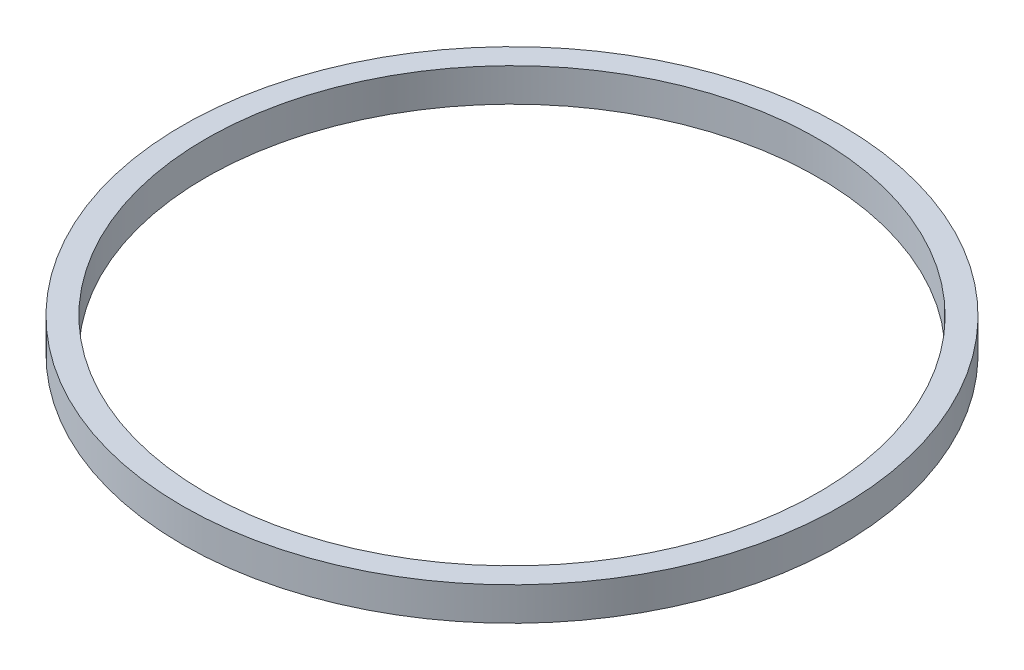
ISO-10303-21;
HEADER;
FILE_DESCRIPTION(('STEP AP214'),'2;1');
FILE_NAME('part.step','',(''),(''),'','','');
FILE_SCHEMA(('AUTOMOTIVE_DESIGN { 1 0 10303 214 1 1 1 1 }'));
ENDSEC;
DATA;
#1=APPLICATION_CONTEXT('core data for automotive mechanical design processes');
#2=APPLICATION_PROTOCOL_DEFINITION('international standard','automotive_design',2000,#1);
#3=PRODUCT_CONTEXT('',#1,'mechanical');
#4=PRODUCT('Part','Part','',(#3));
#5=PRODUCT_RELATED_PRODUCT_CATEGORY('part','',(#4));
#6=PRODUCT_DEFINITION_FORMATION('','',#4);
#7=PRODUCT_DEFINITION_CONTEXT('part definition',#1,'design');
#8=PRODUCT_DEFINITION('design','',#6,#7);
#9=PRODUCT_DEFINITION_SHAPE('','',#8);
#10=(LENGTH_UNIT() NAMED_UNIT(*) SI_UNIT(.MILLI.,.METRE.));
#11=(NAMED_UNIT(*) PLANE_ANGLE_UNIT() SI_UNIT($,.RADIAN.));
#12=(NAMED_UNIT(*) SI_UNIT($,.STERADIAN.) SOLID_ANGLE_UNIT());
#13=UNCERTAINTY_MEASURE_WITH_UNIT(LENGTH_MEASURE(1.E-05),#10,'distance_accuracy_value','');
#14=(GEOMETRIC_REPRESENTATION_CONTEXT(3) GLOBAL_UNCERTAINTY_ASSIGNED_CONTEXT((#13)) GLOBAL_UNIT_ASSIGNED_CONTEXT((#10,
#11,#12)) REPRESENTATION_CONTEXT('',''));
#15=CARTESIAN_POINT('',(0.,0.,0.));
#16=DIRECTION('',(0.,0.,1.));
#17=DIRECTION('',(1.,0.,0.));
#18=AXIS2_PLACEMENT_3D('',#15,#16,#17);
#19=CARTESIAN_POINT('',(0.,109.22,0.));
#20=DIRECTION('',(0.,1.,0.));
#21=DIRECTION('',(0.,0.,1.));
#22=AXIS2_PLACEMENT_3D('',#19,#20,#21);
#23=PLANE('',#22);
#24=CARTESIAN_POINT('',(0.,109.22,0.));
#25=DIRECTION('',(0.,1.,0.));
#26=DIRECTION('',(0.,0.,1.));
#27=AXIS2_PLACEMENT_3D('',#24,#25,#26);
#28=CIRCLE('',#27,1079.5);
#29=CARTESIAN_POINT('',(0.,109.22,1079.5));
#30=VERTEX_POINT('',#29);
#31=EDGE_CURVE('E10',#30,#30,#28,.T.);
#32=ORIENTED_EDGE('',*,*,#31,.T.);
#33=EDGE_LOOP('',(#32));
#34=FACE_BOUND('',#33,.T.);
#35=CARTESIAN_POINT('',(0.,109.22,0.));
#36=DIRECTION('',(0.,1.,0.));
#37=DIRECTION('',(0.,0.,1.));
#38=AXIS2_PLACEMENT_3D('',#35,#36,#37);
#39=CIRCLE('',#38,1003.3);
#40=CARTESIAN_POINT('',(0.,109.22,1003.3));
#41=VERTEX_POINT('',#40);
#42=EDGE_CURVE('E50',#41,#41,#39,.T.);
#43=ORIENTED_EDGE('',*,*,#42,.F.);
#44=EDGE_LOOP('',(#43));
#45=FACE_BOUND('',#44,.T.);
#46=ADVANCED_FACE('F37',(#34,#45),#23,.T.);
#47=CARTESIAN_POINT('',(0.,0.,0.));
#48=DIRECTION('',(0.,1.,0.));
#49=DIRECTION('',(0.,0.,1.));
#50=AXIS2_PLACEMENT_3D('',#47,#48,#49);
#51=PLANE('',#50);
#52=CARTESIAN_POINT('',(0.,0.,0.));
#53=DIRECTION('',(0.,1.,0.));
#54=DIRECTION('',(0.,0.,1.));
#55=AXIS2_PLACEMENT_3D('',#52,#53,#54);
#56=CIRCLE('',#55,1079.5);
#57=CARTESIAN_POINT('',(0.,0.,1079.5));
#58=VERTEX_POINT('',#57);
#59=EDGE_CURVE('E41',#58,#58,#56,.T.);
#60=ORIENTED_EDGE('',*,*,#59,.F.);
#61=EDGE_LOOP('',(#60));
#62=FACE_BOUND('',#61,.T.);
#63=CARTESIAN_POINT('',(0.,0.,0.));
#64=DIRECTION('',(0.,1.,0.));
#65=DIRECTION('',(0.,0.,1.));
#66=AXIS2_PLACEMENT_3D('',#63,#64,#65);
#67=CIRCLE('',#66,1003.3);
#68=CARTESIAN_POINT('',(0.,0.,1003.3));
#69=VERTEX_POINT('',#68);
#70=EDGE_CURVE('E52',#69,#69,#67,.T.);
#71=ORIENTED_EDGE('',*,*,#70,.T.);
#72=EDGE_LOOP('',(#71));
#73=FACE_BOUND('',#72,.T.);
#74=ADVANCED_FACE('F64',(#62,#73),#51,.F.);
#75=CARTESIAN_POINT('',(0.,109.22,0.));
#76=DIRECTION('',(0.,-1.,0.));
#77=DIRECTION('',(0.,0.,-1.));
#78=AXIS2_PLACEMENT_3D('',#75,#76,#77);
#79=CYLINDRICAL_SURFACE('',#78,1079.5);
#80=ORIENTED_EDGE('',*,*,#31,.F.);
#81=EDGE_LOOP('',(#80));
#82=FACE_BOUND('',#81,.T.);
#83=ORIENTED_EDGE('',*,*,#59,.T.);
#84=EDGE_LOOP('',(#83));
#85=FACE_BOUND('',#84,.T.);
#86=ADVANCED_FACE('F39',(#82,#85),#79,.T.);
#87=CARTESIAN_POINT('',(0.,109.22,0.));
#88=DIRECTION('',(0.,-1.,0.));
#89=DIRECTION('',(0.,0.,-1.));
#90=AXIS2_PLACEMENT_3D('',#87,#88,#89);
#91=CYLINDRICAL_SURFACE('',#90,1003.3);
#92=ORIENTED_EDGE('',*,*,#42,.T.);
#93=EDGE_LOOP('',(#92));
#94=FACE_BOUND('',#93,.T.);
#95=ORIENTED_EDGE('',*,*,#70,.F.);
#96=EDGE_LOOP('',(#95));
#97=FACE_BOUND('',#96,.T.);
#98=ADVANCED_FACE('F60',(#94,#97),#91,.F.);
#99=CLOSED_SHELL('',(#46,#74,#86,#98));
#100=MANIFOLD_SOLID_BREP('B2',#99);
#101=ADVANCED_BREP_SHAPE_REPRESENTATION('',(#18,#100),#14);
#102=SHAPE_DEFINITION_REPRESENTATION(#9,#101);
ENDSEC;
END-ISO-10303-21;
